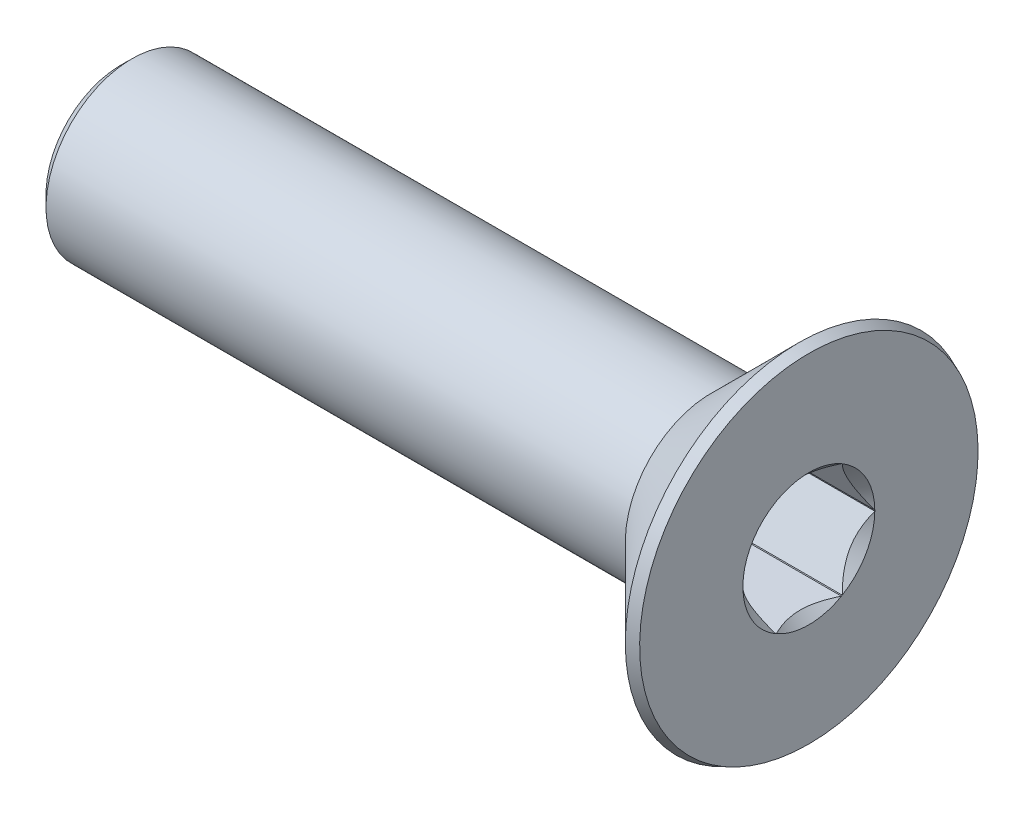
ISO-10303-21;
HEADER;
FILE_DESCRIPTION(('STEP AP214'),'2;1');
FILE_NAME('part.step','',(''),(''),'','','');
FILE_SCHEMA(('AUTOMOTIVE_DESIGN { 1 0 10303 214 1 1 1 1 }'));
ENDSEC;
DATA;
#1=APPLICATION_CONTEXT('core data for automotive mechanical design processes');
#2=APPLICATION_PROTOCOL_DEFINITION('international standard','automotive_design',2000,#1);
#3=PRODUCT_CONTEXT('',#1,'mechanical');
#4=PRODUCT('Part','Part','',(#3));
#5=PRODUCT_RELATED_PRODUCT_CATEGORY('part','',(#4));
#6=PRODUCT_DEFINITION_FORMATION('','',#4);
#7=PRODUCT_DEFINITION_CONTEXT('part definition',#1,'design');
#8=PRODUCT_DEFINITION('design','',#6,#7);
#9=PRODUCT_DEFINITION_SHAPE('','',#8);
#10=(LENGTH_UNIT() NAMED_UNIT(*) SI_UNIT(.MILLI.,.METRE.));
#11=(NAMED_UNIT(*) PLANE_ANGLE_UNIT() SI_UNIT($,.RADIAN.));
#12=(NAMED_UNIT(*) SI_UNIT($,.STERADIAN.) SOLID_ANGLE_UNIT());
#13=UNCERTAINTY_MEASURE_WITH_UNIT(LENGTH_MEASURE(1.E-05),#10,'distance_accuracy_value','');
#14=(GEOMETRIC_REPRESENTATION_CONTEXT(3) GLOBAL_UNCERTAINTY_ASSIGNED_CONTEXT((#13)) GLOBAL_UNIT_ASSIGNED_CONTEXT((#10,
#11,#12)) REPRESENTATION_CONTEXT('',''));
#15=CARTESIAN_POINT('',(0.,0.,0.));
#16=DIRECTION('',(0.,0.,1.));
#17=DIRECTION('',(1.,0.,0.));
#18=AXIS2_PLACEMENT_3D('',#15,#16,#17);
#19=CARTESIAN_POINT('',(3.3333911777,-22.5652643177,178.13));
#20=DIRECTION('',(1.,0.,0.));
#21=DIRECTION('',(0.,1.,0.));
#22=AXIS2_PLACEMENT_3D('',#19,#20,#21);
#23=CYLINDRICAL_SURFACE('',#22,1.15);
#24=CARTESIAN_POINT('',(3.3333911777,-22.5652643177,178.13));
#25=DIRECTION('',(1.,0.,0.));
#26=DIRECTION('',(0.,1.,0.));
#27=AXIS2_PLACEMENT_3D('',#24,#25,#26);
#28=CIRCLE('',#27,1.15);
#29=CARTESIAN_POINT('',(3.33339117770549,-21.5734564283759,177.547920013506));
#30=VERTEX_POINT('',#29);
#31=CARTESIAN_POINT('',(3.33339117770511,-21.5652643177,177.56210916542));
#32=VERTEX_POINT('',#31);
#33=EDGE_CURVE('E118',#30,#32,#28,.T.);
#34=ORIENTED_EDGE('',*,*,#33,.F.);
#35=DIRECTION('',(1.,0.,0.));
#36=VECTOR('',#35,1.);
#37=CARTESIAN_POINT('',(6.0333911777,-21.5734564283741,177.547920013507));
#38=LINE('',#37,#36);
#39=CARTESIAN_POINT('',(5.03339117772478,-21.5734564283759,177.547920013506));
#40=VERTEX_POINT('',#39);
#41=EDGE_CURVE('E120',#40,#30,#38,.F.);
#42=ORIENTED_EDGE('',*,*,#41,.F.);
#43=CARTESIAN_POINT('',(5.0333911777,-22.5652643177,178.13));
#44=DIRECTION('',(-1.,0.,0.));
#45=DIRECTION('',(0.,-1.,0.));
#46=AXIS2_PLACEMENT_3D('',#43,#44,#45);
#47=CIRCLE('',#46,1.15);
#48=CARTESIAN_POINT('',(5.03339117772374,-21.5652643177,177.56210916542));
#49=VERTEX_POINT('',#48);
#50=EDGE_CURVE('E19',#49,#40,#47,.T.);
#51=ORIENTED_EDGE('',*,*,#50,.F.);
#52=DIRECTION('',(1.,0.,0.));
#53=VECTOR('',#52,1.);
#54=CARTESIAN_POINT('',(6.0333911777,-21.5652643177,177.56210916542));
#55=LINE('',#54,#53);
#56=EDGE_CURVE('E237',#32,#49,#55,.T.);
#57=ORIENTED_EDGE('',*,*,#56,.F.);
#58=EDGE_LOOP('',(#34,#42,#51,#57));
#59=FACE_BOUND('',#58,.T.);
#60=ADVANCED_FACE('F16',(#59),#23,.F.);
#61=CARTESIAN_POINT('',(3.3333911777,-22.5652643177,178.13));
#62=DIRECTION('',(1.,0.,0.));
#63=DIRECTION('',(0.,1.,0.));
#64=AXIS2_PLACEMENT_3D('',#61,#62,#63);
#65=CYLINDRICAL_SURFACE('',#64,1.15);
#66=CARTESIAN_POINT('',(3.3333911777,-22.5652643177,178.13));
#67=DIRECTION('',(1.,0.,0.));
#68=DIRECTION('',(0.,1.,0.));
#69=AXIS2_PLACEMENT_3D('',#66,#67,#68);
#70=CIRCLE('',#69,1.15);
#71=CARTESIAN_POINT('',(3.33339117770511,-21.5652643177,178.69789083458));
#72=VERTEX_POINT('',#71);
#73=CARTESIAN_POINT('',(3.33339117770457,-21.5734564283715,178.712079986482));
#74=VERTEX_POINT('',#73);
#75=EDGE_CURVE('E193',#72,#74,#70,.T.);
#76=ORIENTED_EDGE('',*,*,#75,.F.);
#77=DIRECTION('',(1.,0.,0.));
#78=VECTOR('',#77,1.);
#79=CARTESIAN_POINT('',(6.0333911777,-21.5652643177,178.69789083458));
#80=LINE('',#79,#78);
#81=CARTESIAN_POINT('',(5.03339117772374,-21.5652643177,178.69789083458));
#82=VERTEX_POINT('',#81);
#83=EDGE_CURVE('E125',#82,#72,#80,.F.);
#84=ORIENTED_EDGE('',*,*,#83,.F.);
#85=CARTESIAN_POINT('',(5.0333911777,-22.5652643177,178.13));
#86=DIRECTION('',(-1.,0.,0.));
#87=DIRECTION('',(0.,-1.,0.));
#88=AXIS2_PLACEMENT_3D('',#85,#86,#87);
#89=CIRCLE('',#88,1.15);
#90=CARTESIAN_POINT('',(5.03339117772227,-21.5734564283715,178.712079986482));
#91=VERTEX_POINT('',#90);
#92=EDGE_CURVE('E194',#91,#82,#89,.T.);
#93=ORIENTED_EDGE('',*,*,#92,.F.);
#94=DIRECTION('',(1.,0.,0.));
#95=VECTOR('',#94,1.);
#96=CARTESIAN_POINT('',(6.0333911777,-21.5734564283741,178.712079986483));
#97=LINE('',#96,#95);
#98=EDGE_CURVE('E236',#74,#91,#97,.T.);
#99=ORIENTED_EDGE('',*,*,#98,.F.);
#100=EDGE_LOOP('',(#76,#84,#93,#99));
#101=FACE_BOUND('',#100,.T.);
#102=ADVANCED_FACE('F388',(#101),#65,.F.);
#103=CARTESIAN_POINT('',(3.3333911777,-22.5652643177,178.13));
#104=DIRECTION('',(1.,0.,0.));
#105=DIRECTION('',(0.,1.,0.));
#106=AXIS2_PLACEMENT_3D('',#103,#104,#105);
#107=CYLINDRICAL_SURFACE('',#106,1.15);
#108=CARTESIAN_POINT('',(3.3333911777,-22.5652643177,178.13));
#109=DIRECTION('',(1.,0.,0.));
#110=DIRECTION('',(0.,1.,0.));
#111=AXIS2_PLACEMENT_3D('',#108,#109,#110);
#112=CIRCLE('',#111,1.15);
#113=CARTESIAN_POINT('',(3.33339117770344,-22.5570722070308,179.27997082107));
#114=VERTEX_POINT('',#113);
#115=CARTESIAN_POINT('',(3.33339117770557,-22.5734564283763,179.279970821076));
#116=VERTEX_POINT('',#115);
#117=EDGE_CURVE('E191',#114,#116,#112,.T.);
#118=ORIENTED_EDGE('',*,*,#117,.F.);
#119=DIRECTION('',(1.,0.,0.));
#120=VECTOR('',#119,1.);
#121=CARTESIAN_POINT('',(6.0333911777,-22.5570722070227,179.279970821065));
#122=LINE('',#121,#120);
#123=CARTESIAN_POINT('',(5.03339117771689,-22.5570722070269,179.279970821068));
#124=VERTEX_POINT('',#123);
#125=EDGE_CURVE('E231',#124,#114,#122,.F.);
#126=ORIENTED_EDGE('',*,*,#125,.F.);
#127=CARTESIAN_POINT('',(5.0333911777,-22.5652643177,178.13));
#128=DIRECTION('',(-1.,0.,0.));
#129=DIRECTION('',(0.,-1.,0.));
#130=AXIS2_PLACEMENT_3D('',#127,#128,#129);
#131=CIRCLE('',#130,1.15);
#132=CARTESIAN_POINT('',(5.03339117772502,-22.5734564283763,179.279970821076));
#133=VERTEX_POINT('',#132);
#134=EDGE_CURVE('E192',#133,#124,#131,.T.);
#135=ORIENTED_EDGE('',*,*,#134,.F.);
#136=DIRECTION('',(1.,0.,0.));
#137=VECTOR('',#136,1.);
#138=CARTESIAN_POINT('',(6.0333911777,-22.573456428374,179.279970821077));
#139=LINE('',#138,#137);
#140=EDGE_CURVE('E309',#116,#133,#139,.T.);
#141=ORIENTED_EDGE('',*,*,#140,.F.);
#142=EDGE_LOOP('',(#118,#126,#135,#141));
#143=FACE_BOUND('',#142,.T.);
#144=ADVANCED_FACE('F232',(#143),#107,.F.);
#145=CARTESIAN_POINT('',(3.3333911777,-22.5652643177,178.13));
#146=DIRECTION('',(1.,0.,0.));
#147=DIRECTION('',(0.,1.,0.));
#148=AXIS2_PLACEMENT_3D('',#145,#146,#147);
#149=CYLINDRICAL_SURFACE('',#148,1.15);
#150=CARTESIAN_POINT('',(3.3333911777,-22.5652643177,178.13));
#151=DIRECTION('',(1.,0.,0.));
#152=DIRECTION('',(0.,1.,0.));
#153=AXIS2_PLACEMENT_3D('',#150,#151,#152);
#154=CIRCLE('',#153,1.15);
#155=CARTESIAN_POINT('',(3.33339117770515,-23.5570722070225,178.712079986495));
#156=VERTEX_POINT('',#155);
#157=CARTESIAN_POINT('',(3.33339117770511,-23.5652643177,178.69789083458));
#158=VERTEX_POINT('',#157);
#159=EDGE_CURVE('E188',#156,#158,#154,.T.);
#160=ORIENTED_EDGE('',*,*,#159,.F.);
#161=DIRECTION('',(1.,0.,0.));
#162=VECTOR('',#161,1.);
#163=CARTESIAN_POINT('',(6.0333911777,-23.5570722070227,178.712079986495));
#164=LINE('',#163,#162);
#165=CARTESIAN_POINT('',(5.03339117772386,-23.5570722070231,178.712079986494));
#166=VERTEX_POINT('',#165);
#167=EDGE_CURVE('E314',#166,#156,#164,.F.);
#168=ORIENTED_EDGE('',*,*,#167,.F.);
#169=CARTESIAN_POINT('',(5.0333911777,-22.5652643177,178.13));
#170=DIRECTION('',(-1.,0.,0.));
#171=DIRECTION('',(0.,-1.,0.));
#172=AXIS2_PLACEMENT_3D('',#169,#170,#171);
#173=CIRCLE('',#172,1.15);
#174=CARTESIAN_POINT('',(5.03339117772374,-23.5652643177,178.69789083458));
#175=VERTEX_POINT('',#174);
#176=EDGE_CURVE('E189',#175,#166,#173,.T.);
#177=ORIENTED_EDGE('',*,*,#176,.F.);
#178=DIRECTION('',(-1.,0.,0.));
#179=VECTOR('',#178,1.);
#180=CARTESIAN_POINT('',(6.0333911777,-23.5652643177,178.69789083458));
#181=LINE('',#180,#179);
#182=EDGE_CURVE('E296',#158,#175,#181,.F.);
#183=ORIENTED_EDGE('',*,*,#182,.F.);
#184=EDGE_LOOP('',(#160,#168,#177,#183));
#185=FACE_BOUND('',#184,.T.);
#186=ADVANCED_FACE('F306',(#185),#149,.F.);
#187=CARTESIAN_POINT('',(3.3333911777,-22.5652643177,178.13));
#188=DIRECTION('',(1.,0.,0.));
#189=DIRECTION('',(0.,1.,0.));
#190=AXIS2_PLACEMENT_3D('',#187,#188,#189);
#191=CYLINDRICAL_SURFACE('',#190,1.15);
#192=CARTESIAN_POINT('',(3.3333911777,-22.5652643177,178.13));
#193=DIRECTION('',(1.,0.,0.));
#194=DIRECTION('',(0.,1.,0.));
#195=AXIS2_PLACEMENT_3D('',#192,#193,#194);
#196=CIRCLE('',#195,1.15);
#197=CARTESIAN_POINT('',(3.33339117770511,-23.5652643177,177.56210916542));
#198=VERTEX_POINT('',#197);
#199=CARTESIAN_POINT('',(3.33339117770472,-23.5570722070203,177.547920013504));
#200=VERTEX_POINT('',#199);
#201=EDGE_CURVE('E126',#198,#200,#196,.T.);
#202=ORIENTED_EDGE('',*,*,#201,.F.);
#203=DIRECTION('',(-1.,0.,0.));
#204=VECTOR('',#203,1.);
#205=CARTESIAN_POINT('',(6.0333911777,-23.5652643177,177.56210916542));
#206=LINE('',#205,#204);
#207=CARTESIAN_POINT('',(5.03339117772374,-23.5652643177,177.56210916542));
#208=VERTEX_POINT('',#207);
#209=EDGE_CURVE('E299',#208,#198,#206,.T.);
#210=ORIENTED_EDGE('',*,*,#209,.F.);
#211=CARTESIAN_POINT('',(5.0333911777,-22.5652643177,178.13));
#212=DIRECTION('',(-1.,0.,0.));
#213=DIRECTION('',(0.,-1.,0.));
#214=AXIS2_PLACEMENT_3D('',#211,#212,#213);
#215=CIRCLE('',#214,1.15);
#216=CARTESIAN_POINT('',(5.03339117772266,-23.5570722070203,177.547920013504));
#217=VERTEX_POINT('',#216);
#218=EDGE_CURVE('E186',#217,#208,#215,.T.);
#219=ORIENTED_EDGE('',*,*,#218,.F.);
#220=DIRECTION('',(1.,0.,0.));
#221=VECTOR('',#220,1.);
#222=CARTESIAN_POINT('',(6.0333911777,-23.5570722070184,177.547920013503));
#223=LINE('',#222,#221);
#224=EDGE_CURVE('E181',#200,#217,#223,.T.);
#225=ORIENTED_EDGE('',*,*,#224,.F.);
#226=EDGE_LOOP('',(#202,#210,#219,#225));
#227=FACE_BOUND('',#226,.T.);
#228=ADVANCED_FACE('F380',(#227),#191,.F.);
#229=CARTESIAN_POINT('',(6.0333911777,-21.5652643177,177.55264973081));
#230=DIRECTION('',(0.,-0.50000000000019,0.866025403784329));
#231=DIRECTION('',(0.,-0.866025403784329,-0.50000000000019));
#232=AXIS2_PLACEMENT_3D('',#229,#230,#231);
#233=PLANE('',#232);
#234=CARTESIAN_POINT('',(3.33339117770996,-21.573456428379,177.547920013504));
#235=CARTESIAN_POINT('',(3.3249330269977,-21.6141953195101,177.524399403743));
#236=CARTESIAN_POINT('',(3.31724672331336,-21.6550662207822,177.500802577892));
#237=CARTESIAN_POINT('',(3.30373346471285,-21.7370668502727,177.453459492382));
#238=CARTESIAN_POINT('',(3.29790788354163,-21.7781967469649,177.429713135455));
#239=CARTESIAN_POINT('',(3.28848860798743,-21.8602712214272,177.38232741553));
#240=CARTESIAN_POINT('',(3.28487489664175,-21.9012140291637,177.358689074462));
#241=CARTESIAN_POINT('',(3.28002879471618,-21.9831926892112,177.311358673016));
#242=CARTESIAN_POINT('',(3.27879556162498,-22.0242285034549,177.287666634616));
#243=CARTESIAN_POINT('',(3.27879556162494,-22.1063001319422,177.240282557816));
#244=CARTESIAN_POINT('',(3.28002879471609,-22.1473359461858,177.216590519416));
#245=CARTESIAN_POINT('',(3.28487489664158,-22.2293146062333,177.16926011797));
#246=CARTESIAN_POINT('',(3.28848860798723,-22.2702574139698,177.145621776902));
#247=CARTESIAN_POINT('',(3.29790788354135,-22.3523318884321,177.098236056977));
#248=CARTESIAN_POINT('',(3.30373346471254,-22.3934617851243,177.07448970005));
#249=CARTESIAN_POINT('',(3.31724672331298,-22.4754624146148,177.02714661454));
#250=CARTESIAN_POINT('',(3.3249330269973,-22.516333315887,177.003549788689));
#251=CARTESIAN_POINT('',(3.33339117770953,-22.5570722070181,176.980029178927));
#252=B_SPLINE_CURVE_WITH_KNOTS('',3,(#234,#235,#236,#237,#238,#239,#240,#241,#242,#243,#244,
#245,#246,#247,#248,#249,#250,#251),.UNSPECIFIED.,.F.,.F.,(4,2,2,2,2,2,2,2,4),(0.,
0.143400587529677,0.286906802260735,0.429094334749749,0.571231534249904,0.713368733750055,
0.855556266239072,0.999062480970127,1.14246306849983),.UNSPECIFIED.);
#253=CARTESIAN_POINT('',(3.33339117770477,-22.5570722070191,176.980029178927));
#254=VERTEX_POINT('',#253);
#255=EDGE_CURVE('E321',#30,#254,#252,.T.);
#256=ORIENTED_EDGE('',*,*,#255,.T.);
#257=DIRECTION('',(1.,0.,0.));
#258=VECTOR('',#257,1.);
#259=CARTESIAN_POINT('',(3.3333911777,-22.55707220702,176.980029178926));
#260=LINE('',#259,#258);
#261=CARTESIAN_POINT('',(5.03339117772375,-22.55707220702,176.980029178926));
#262=VERTEX_POINT('',#261);
#263=EDGE_CURVE('E132',#254,#262,#260,.T.);
#264=ORIENTED_EDGE('',*,*,#263,.T.);
#265=CARTESIAN_POINT('',(5.03339117774062,-22.5570722070094,176.980029178933));
#266=CARTESIAN_POINT('',(5.0140868733409,-22.5231882795344,176.999592073581));
#267=CARTESIAN_POINT('',(4.99593845726014,-22.4887428394203,177.019479157704));
#268=CARTESIAN_POINT('',(4.96274908779519,-22.4185333290583,177.060014637411));
#269=CARTESIAN_POINT('',(4.9477259430806,-22.3827630005034,177.080666646231));
#270=CARTESIAN_POINT('',(4.92201492889679,-22.3106394296964,177.122307209251));
#271=CARTESIAN_POINT('',(4.9112643303234,-22.2743034432312,177.143285800818));
#272=CARTESIAN_POINT('',(4.89472363622478,-22.2008560884682,177.185690650862));
#273=CARTESIAN_POINT('',(4.88892171507279,-22.163746786966,177.207115716074));
#274=CARTESIAN_POINT('',(4.88367875841517,-22.099380248172,177.244277754573));
#275=CARTESIAN_POINT('',(4.8829332749302,-22.0722002176509,177.259970152511));
#276=CARTESIAN_POINT('',(4.88439360695065,-22.0178971966377,177.291322016311));
#277=CARTESIAN_POINT('',(4.88660010847758,-21.9907742208719,177.306981473671));
#278=CARTESIAN_POINT('',(4.89749944482835,-21.9098016325089,177.353731019359));
#279=CARTESIAN_POINT('',(4.91047299049997,-21.8563600369965,177.384585538914));
#280=CARTESIAN_POINT('',(4.94114265261795,-21.7642450043263,177.437768177823));
#281=CARTESIAN_POINT('',(4.95699333845404,-21.7250708189487,177.460385404296));
#282=CARTESIAN_POINT('',(4.99258085077193,-21.648202461662,177.504765371067));
#283=CARTESIAN_POINT('',(5.0123047954768,-21.6105038675813,177.526530664508));
#284=CARTESIAN_POINT('',(5.03339117774144,-21.5734564283883,177.547920013499));
#285=B_SPLINE_CURVE_WITH_KNOTS('',3,(#265,#266,#267,#268,#269,#270,#271,#272,#273,#274,#275,
#276,#277,#278,#279,#280,#281,#282,#283,#284),.UNSPECIFIED.,.F.,.F.,(4,2,2,2,2,2,2,2,2,4),(0.,
0.13097402612549,0.262675086145719,0.392363968763176,0.521742064544273,0.615786259227387,
0.709852312947311,0.898024321761643,1.04164336130838,1.18479260075275),.UNSPECIFIED.);
#286=EDGE_CURVE('E129',#262,#40,#285,.T.);
#287=ORIENTED_EDGE('',*,*,#286,.T.);
#288=ORIENTED_EDGE('',*,*,#41,.T.);
#289=EDGE_LOOP('',(#256,#264,#287,#288));
#290=FACE_BOUND('',#289,.T.);
#291=ADVANCED_FACE('F130',(#290),#233,.T.);
#292=CARTESIAN_POINT('',(6.0333911777,-21.5652643177,178.70735026919));
#293=DIRECTION('',(0.,-1.,0.));
#294=DIRECTION('',(1.,0.,0.));
#295=AXIS2_PLACEMENT_3D('',#292,#293,#294);
#296=PLANE('',#295);
#297=CARTESIAN_POINT('',(3.33339117770962,-21.5652643177,178.697890834577));
#298=CARTESIAN_POINT('',(3.32493302699737,-21.5652643177,178.650849615055));
#299=CARTESIAN_POINT('',(3.31724672331303,-21.5652643177,178.603655963352));
#300=CARTESIAN_POINT('',(3.30373346471255,-21.5652643177,178.508969792331));
#301=CARTESIAN_POINT('',(3.29790788354133,-21.5652643177,178.461477078477));
#302=CARTESIAN_POINT('',(3.28848860798717,-21.5652643177,178.366705638629));
#303=CARTESIAN_POINT('',(3.2848748966415,-21.5652643177,178.319428956492));
#304=CARTESIAN_POINT('',(3.28002879471597,-21.5652643177,178.2247681536));
#305=CARTESIAN_POINT('',(3.27879556162479,-21.5652643177,178.1773840768));
#306=CARTESIAN_POINT('',(3.27879556162479,-21.5652643177,178.0826159232));
#307=CARTESIAN_POINT('',(3.28002879471597,-21.5652643177,178.0352318464));
#308=CARTESIAN_POINT('',(3.2848748966415,-21.5652643177,177.940571043508));
#309=CARTESIAN_POINT('',(3.28848860798717,-21.5652643177,177.893294361371));
#310=CARTESIAN_POINT('',(3.29790788354133,-21.5652643177,177.798522921523));
#311=CARTESIAN_POINT('',(3.30373346471255,-21.5652643177,177.751030207669));
#312=CARTESIAN_POINT('',(3.31724672331303,-21.5652643177,177.656344036648));
#313=CARTESIAN_POINT('',(3.32493302699737,-21.5652643177,177.609150384945));
#314=CARTESIAN_POINT('',(3.33339117770962,-21.5652643177,177.562109165423));
#315=B_SPLINE_CURVE_WITH_KNOTS('',3,(#297,#298,#299,#300,#301,#302,#303,#304,#305,#306,#307,
#308,#309,#310,#311,#312,#313,#314),.UNSPECIFIED.,.F.,.F.,(4,2,2,2,2,2,2,2,4),(0.,
0.143400587529756,0.286906802260814,0.429094334749866,0.571231534250032,0.713368733750197,
0.85555626623925,0.999062480970308,1.14246306850006),.UNSPECIFIED.);
#316=EDGE_CURVE('E276',#72,#32,#315,.T.);
#317=ORIENTED_EDGE('',*,*,#316,.T.);
#318=ORIENTED_EDGE('',*,*,#56,.T.);
#319=CARTESIAN_POINT('',(5.03339117773556,-21.5652643176881,177.562109165431));
#320=CARTESIAN_POINT('',(5.01408687333897,-21.5652643176957,177.601234954731));
#321=CARTESIAN_POINT('',(4.99593845725937,-21.5652643176988,177.641009122976));
#322=CARTESIAN_POINT('',(4.96274908779501,-21.5652643177012,177.722080082392));
#323=CARTESIAN_POINT('',(4.94772594307984,-21.5652643177003,177.763384100033));
#324=CARTESIAN_POINT('',(4.92201492889549,-21.5652643176997,177.846665226075));
#325=CARTESIAN_POINT('',(4.91126433032213,-21.5652643176999,177.888622409209));
#326=CARTESIAN_POINT('',(4.89472363622362,-21.5652643177001,177.973432109298));
#327=CARTESIAN_POINT('',(4.88892171507172,-21.5652643177,178.016282239722));
#328=CARTESIAN_POINT('',(4.88367875841446,-21.5652643177,178.090606316722));
#329=CARTESIAN_POINT('',(4.88293327492969,-21.5652643177,178.121991112598));
#330=CARTESIAN_POINT('',(4.88439360695055,-21.5652643177,178.184694840198));
#331=CARTESIAN_POINT('',(4.8866001084777,-21.5652643177,178.216013754918));
#332=CARTESIAN_POINT('',(4.89749944482915,-21.5652643177,178.309512846295));
#333=CARTESIAN_POINT('',(4.91047299050123,-21.5652643177,178.371221885405));
#334=CARTESIAN_POINT('',(4.94114265261959,-21.5652643177,178.477587163221));
#335=CARTESIAN_POINT('',(4.95699333845546,-21.5652643177,178.522821616166));
#336=CARTESIAN_POINT('',(4.99258085077269,-21.5652643177,178.611581549707));
#337=CARTESIAN_POINT('',(5.01230479547712,-21.5652643177,178.655112136587));
#338=CARTESIAN_POINT('',(5.03339117774126,-21.5652643177,178.697890834567));
#339=B_SPLINE_CURVE_WITH_KNOTS('',3,(#319,#320,#321,#322,#323,#324,#325,#326,#327,#328,#329,
#330,#331,#332,#333,#334,#335,#336,#337,#338),.UNSPECIFIED.,.F.,.F.,(4,2,2,2,2,2,2,2,2,4),(0.,
0.130974026127057,0.262675086149201,0.392363968768692,0.521742064551702,0.615786259235275,
0.709852312955758,0.898024321770856,1.04164336131394,1.18479260075476),.UNSPECIFIED.);
#340=EDGE_CURVE('E134',#49,#82,#339,.T.);
#341=ORIENTED_EDGE('',*,*,#340,.T.);
#342=ORIENTED_EDGE('',*,*,#83,.T.);
#343=EDGE_LOOP('',(#317,#318,#341,#342));
#344=FACE_BOUND('',#343,.T.);
#345=ADVANCED_FACE('F265',(#344),#296,.T.);
#346=CARTESIAN_POINT('',(6.0333911777,-22.5652643177,179.28470053837));
#347=DIRECTION('',(0.,-0.50000000000019,-0.866025403784329));
#348=DIRECTION('',(0.,0.866025403784329,-0.50000000000019));
#349=AXIS2_PLACEMENT_3D('',#346,#347,#348);
#350=PLANE('',#349);
#351=CARTESIAN_POINT('',(3.33339117770658,-22.5570722070213,179.279970821064));
#352=CARTESIAN_POINT('',(3.32493302699426,-22.51633331589,179.256450211303));
#353=CARTESIAN_POINT('',(3.31724672330988,-22.4754624146176,179.232853385452));
#354=CARTESIAN_POINT('',(3.30373346470933,-22.3934617851267,179.185510299941));
#355=CARTESIAN_POINT('',(3.29790788353809,-22.3523318884343,179.161763943014));
#356=CARTESIAN_POINT('',(3.28848860798394,-22.2702574139716,179.11437822309));
#357=CARTESIAN_POINT('',(3.28487489663829,-22.229314606235,179.090739882021));
#358=CARTESIAN_POINT('',(3.28002879471285,-22.1473359461871,179.043409480575));
#359=CARTESIAN_POINT('',(3.27879556162174,-22.1063001319432,179.019717442175));
#360=CARTESIAN_POINT('',(3.27879556162192,-22.0242285034555,178.972333365375));
#361=CARTESIAN_POINT('',(3.28002879471321,-21.9831926892117,178.948641326974));
#362=CARTESIAN_POINT('',(3.284874896639,-21.9012140291638,178.901310925528));
#363=CARTESIAN_POINT('',(3.28848860798481,-21.8602712214272,178.87767258446));
#364=CARTESIAN_POINT('',(3.29790788353928,-21.7781967469645,178.830286864535));
#365=CARTESIAN_POINT('',(3.30373346471066,-21.7370668502721,178.806540507608));
#366=CARTESIAN_POINT('',(3.31724672331147,-21.6550662207813,178.759197422098));
#367=CARTESIAN_POINT('',(3.32493302699598,-21.6141953195089,178.735600596246));
#368=CARTESIAN_POINT('',(3.33339117770841,-21.5734564283776,178.712079986485));
#369=B_SPLINE_CURVE_WITH_KNOTS('',3,(#351,#352,#353,#354,#355,#356,#357,#358,#359,#360,#361,
#362,#363,#364,#365,#366,#367,#368),.UNSPECIFIED.,.F.,.F.,(4,2,2,2,2,2,2,2,4),(0.,
0.143400587530371,0.286906802262135,0.429094334751811,0.571231534252625,0.713368733753432,
0.855556266243112,0.99906248097483,1.14246306850521),.UNSPECIFIED.);
#370=EDGE_CURVE('E271',#114,#74,#369,.T.);
#371=ORIENTED_EDGE('',*,*,#370,.T.);
#372=ORIENTED_EDGE('',*,*,#98,.T.);
#373=CARTESIAN_POINT('',(5.03339117773797,-21.5734564283856,178.71207998649));
#374=CARTESIAN_POINT('',(5.01408687333762,-21.6073403558611,178.731642881139));
#375=CARTESIAN_POINT('',(4.99593845725623,-21.6417857959756,178.751529965261));
#376=CARTESIAN_POINT('',(4.96274908779008,-21.7119953063386,178.792065444969));
#377=CARTESIAN_POINT('',(4.9477259430749,-21.747765634894,178.81271745379));
#378=CARTESIAN_POINT('',(4.92201492889006,-21.8198892057021,178.854358016811));
#379=CARTESIAN_POINT('',(4.91126433031621,-21.8562251921678,178.875336608378));
#380=CARTESIAN_POINT('',(4.89472363621683,-21.929672546932,178.917741458422));
#381=CARTESIAN_POINT('',(4.88892171506456,-21.9667818484348,178.939166523634));
#382=CARTESIAN_POINT('',(4.88367875840668,-22.0311483872292,178.976328562134));
#383=CARTESIAN_POINT('',(4.88293327492163,-22.0583284177501,178.992020960072));
#384=CARTESIAN_POINT('',(4.88439360694189,-22.1126314387629,179.023372823871));
#385=CARTESIAN_POINT('',(4.88660010846872,-22.1397544145285,179.039032281231));
#386=CARTESIAN_POINT('',(4.89749944481916,-22.220727002891,179.085781826919));
#387=CARTESIAN_POINT('',(4.91047299049054,-22.274168598403,179.116636346474));
#388=CARTESIAN_POINT('',(4.94114265260841,-22.3662836310736,179.169818985383));
#389=CARTESIAN_POINT('',(4.95699333844477,-22.4054578164518,179.192436211856));
#390=CARTESIAN_POINT('',(4.99258085076335,-22.4823261737399,179.236816178629));
#391=CARTESIAN_POINT('',(5.01230479546865,-22.5200247678213,179.258581472069));
#392=CARTESIAN_POINT('',(5.03339117773377,-22.5570722070148,179.279970821061));
#393=B_SPLINE_CURVE_WITH_KNOTS('',3,(#373,#374,#375,#376,#377,#378,#379,#380,#381,#382,#383,
#384,#385,#386,#387,#388,#389,#390,#391,#392),.UNSPECIFIED.,.F.,.F.,(4,2,2,2,2,2,2,2,2,4),(0.,
0.130974026127718,0.262675086150222,0.392363968769874,0.52174206455313,0.615786259235568,
0.709852312954807,0.898024321767734,1.04164336131699,1.1847926007639),.UNSPECIFIED.);
#394=EDGE_CURVE('E224',#91,#124,#393,.T.);
#395=ORIENTED_EDGE('',*,*,#394,.T.);
#396=ORIENTED_EDGE('',*,*,#125,.T.);
#397=EDGE_LOOP('',(#371,#372,#395,#396));
#398=FACE_BOUND('',#397,.T.);
#399=ADVANCED_FACE('F240',(#398),#350,.T.);
#400=CARTESIAN_POINT('',(6.0333911777,-23.5652643177,178.70735026919));
#401=DIRECTION('',(0.,0.50000000000019,-0.866025403784329));
#402=DIRECTION('',(0.,0.866025403784329,0.50000000000019));
#403=AXIS2_PLACEMENT_3D('',#400,#401,#402);
#404=PLANE('',#403);
#405=CARTESIAN_POINT('',(3.33339117770991,-23.5570722070208,178.712079986496));
#406=CARTESIAN_POINT('',(3.3249330269976,-23.5163333158895,178.735600596257));
#407=CARTESIAN_POINT('',(3.31724672331322,-23.475462414617,178.759197422109));
#408=CARTESIAN_POINT('',(3.30373346471267,-23.3934617851261,178.806540507619));
#409=CARTESIAN_POINT('',(3.29790788354143,-23.3523318884336,178.830286864546));
#410=CARTESIAN_POINT('',(3.28848860798724,-23.2702574139708,178.877672584471));
#411=CARTESIAN_POINT('',(3.28487489664157,-23.2293146062341,178.901310925539));
#412=CARTESIAN_POINT('',(3.28002879471607,-23.1473359461862,178.948641326986));
#413=CARTESIAN_POINT('',(3.27879556162491,-23.1063001319423,178.972333365386));
#414=CARTESIAN_POINT('',(3.27879556162499,-23.0242285034545,179.019717442186));
#415=CARTESIAN_POINT('',(3.28002879471622,-22.9831926892106,179.043409480586));
#416=CARTESIAN_POINT('',(3.28487489664189,-22.9012140291627,179.090739882033));
#417=CARTESIAN_POINT('',(3.28848860798763,-22.860271221426,179.114378223101));
#418=CARTESIAN_POINT('',(3.29790788354195,-22.7781967469632,179.161763943026));
#419=CARTESIAN_POINT('',(3.30373346471326,-22.7370668502708,179.185510299953));
#420=CARTESIAN_POINT('',(3.31724672331393,-22.6550662207798,179.232853385463));
#421=CARTESIAN_POINT('',(3.32493302699837,-22.6141953195074,179.256450211315));
#422=CARTESIAN_POINT('',(3.33339117771072,-22.5734564283761,179.279970821076));
#423=B_SPLINE_CURVE_WITH_KNOTS('',3,(#405,#406,#407,#408,#409,#410,#411,#412,#413,#414,#415,
#416,#417,#418,#419,#420,#421,#422),.UNSPECIFIED.,.F.,.F.,(4,2,2,2,2,2,2,2,4),(0.,
0.1434005875305,0.286906802262375,0.429094334752203,0.571231534253146,0.713368733754105,
0.855556266243926,0.999062480975802,1.14246306850629),.UNSPECIFIED.);
#424=EDGE_CURVE('E277',#156,#116,#423,.T.);
#425=ORIENTED_EDGE('',*,*,#424,.T.);
#426=ORIENTED_EDGE('',*,*,#140,.T.);
#427=CARTESIAN_POINT('',(5.03339117773897,-22.573456428389,179.27997082108));
#428=CARTESIAN_POINT('',(5.01408687334156,-22.6073403558626,179.260407926424));
#429=CARTESIAN_POINT('',(4.99593845726152,-22.6417857959763,179.240520842299));
#430=CARTESIAN_POINT('',(4.96274908779661,-22.711995306339,179.19998536259));
#431=CARTESIAN_POINT('',(4.94772594308135,-22.7477656348948,179.17933335377));
#432=CARTESIAN_POINT('',(4.92201492889674,-22.8198892057034,179.137692790749));
#433=CARTESIAN_POINT('',(4.9112643303232,-22.8562251921692,179.116714199181));
#434=CARTESIAN_POINT('',(4.89472363622441,-22.9296725469337,179.074309349137));
#435=CARTESIAN_POINT('',(4.8889217150724,-22.9667818484366,179.052884283925));
#436=CARTESIAN_POINT('',(4.88367875841497,-23.0311483872315,179.015722245425));
#437=CARTESIAN_POINT('',(4.88293327493014,-23.0583284177527,179.000029847487));
#438=CARTESIAN_POINT('',(4.88439360695087,-23.1126314387662,178.968677983687));
#439=CARTESIAN_POINT('',(4.88660010847796,-23.1397544145321,178.953018526327));
#440=CARTESIAN_POINT('',(4.89749944482921,-23.2207270028955,178.906268980638));
#441=CARTESIAN_POINT('',(4.91047299050117,-23.274168598408,178.875414461083));
#442=CARTESIAN_POINT('',(4.94114265261948,-23.3662836310777,178.822231822175));
#443=CARTESIAN_POINT('',(4.95699333845545,-23.4054578164546,178.799614595702));
#444=CARTESIAN_POINT('',(4.99258085077296,-23.4823261737401,178.755234628931));
#445=CARTESIAN_POINT('',(5.01230479547757,-23.5200247678202,178.733469335491));
#446=CARTESIAN_POINT('',(5.03339117774191,-23.5570722070125,178.712079986501));
#447=B_SPLINE_CURVE_WITH_KNOTS('',3,(#427,#428,#429,#430,#431,#432,#433,#434,#435,#436,#437,
#438,#439,#440,#441,#442,#443,#444,#445,#446),.UNSPECIFIED.,.F.,.F.,(4,2,2,2,2,2,2,2,2,4),(0.,
0.130974026127759,0.262675086150519,0.392363968770584,0.521742064554247,0.615786259237847,
0.709852312958219,0.898024321773323,1.04164336131776,1.18479260075992),.UNSPECIFIED.);
#448=EDGE_CURVE('E242',#133,#166,#447,.T.);
#449=ORIENTED_EDGE('',*,*,#448,.T.);
#450=ORIENTED_EDGE('',*,*,#167,.T.);
#451=EDGE_LOOP('',(#425,#426,#449,#450));
#452=FACE_BOUND('',#451,.T.);
#453=ADVANCED_FACE('F264',(#452),#404,.T.);
#454=CARTESIAN_POINT('',(6.0333911777,-23.5652643177,177.55264973081));
#455=DIRECTION('',(0.,1.,0.));
#456=DIRECTION('',(-1.,0.,0.));
#457=AXIS2_PLACEMENT_3D('',#454,#455,#456);
#458=PLANE('',#457);
#459=CARTESIAN_POINT('',(3.33339117770963,-23.5652643177,177.562109165423));
#460=CARTESIAN_POINT('',(3.32493302699738,-23.5652643177,177.609150384945));
#461=CARTESIAN_POINT('',(3.31724672331304,-23.5652643177,177.656344036648));
#462=CARTESIAN_POINT('',(3.30373346471256,-23.5652643177,177.751030207669));
#463=CARTESIAN_POINT('',(3.29790788354134,-23.5652643177,177.798522921523));
#464=CARTESIAN_POINT('',(3.28848860798718,-23.5652643177,177.893294361371));
#465=CARTESIAN_POINT('',(3.28487489664151,-23.5652643177,177.940571043508));
#466=CARTESIAN_POINT('',(3.28002879471598,-23.5652643177,178.0352318464));
#467=CARTESIAN_POINT('',(3.2787955616248,-23.5652643177,178.0826159232));
#468=CARTESIAN_POINT('',(3.2787955616248,-23.5652643177,178.1773840768));
#469=CARTESIAN_POINT('',(3.28002879471597,-23.5652643177,178.2247681536));
#470=CARTESIAN_POINT('',(3.28487489664151,-23.5652643177,178.319428956492));
#471=CARTESIAN_POINT('',(3.28848860798717,-23.5652643177,178.366705638629));
#472=CARTESIAN_POINT('',(3.29790788354134,-23.5652643177,178.461477078477));
#473=CARTESIAN_POINT('',(3.30373346471255,-23.5652643177,178.508969792331));
#474=CARTESIAN_POINT('',(3.31724672331303,-23.5652643177,178.603655963352));
#475=CARTESIAN_POINT('',(3.32493302699737,-23.5652643177,178.650849615055));
#476=CARTESIAN_POINT('',(3.33339117770962,-23.5652643177,178.697890834577));
#477=B_SPLINE_CURVE_WITH_KNOTS('',3,(#459,#460,#461,#462,#463,#464,#465,#466,#467,#468,#469,
#470,#471,#472,#473,#474,#475,#476),.UNSPECIFIED.,.F.,.F.,(4,2,2,2,2,2,2,2,4),(0.,
0.143400587529728,0.286906802260786,0.429094334749839,0.571231534250032,0.713368733750225,
0.855556266239278,0.999062480970336,1.14246306850006),.UNSPECIFIED.);
#478=EDGE_CURVE('E180',#198,#158,#477,.T.);
#479=ORIENTED_EDGE('',*,*,#478,.T.);
#480=ORIENTED_EDGE('',*,*,#182,.T.);
#481=CARTESIAN_POINT('',(5.03339117773556,-23.565264317712,178.697890834569));
#482=CARTESIAN_POINT('',(5.01408687333897,-23.5652643177043,178.658765045269));
#483=CARTESIAN_POINT('',(4.99593845725938,-23.5652643177012,178.618990877024));
#484=CARTESIAN_POINT('',(4.96274908779501,-23.5652643176988,178.537919917608));
#485=CARTESIAN_POINT('',(4.94772594307984,-23.5652643176997,178.496615899967));
#486=CARTESIAN_POINT('',(4.9220149288955,-23.5652643177003,178.413334773925));
#487=CARTESIAN_POINT('',(4.91126433032213,-23.5652643177001,178.371377590791));
#488=CARTESIAN_POINT('',(4.89472363622362,-23.5652643176999,178.286567890702));
#489=CARTESIAN_POINT('',(4.88892171507173,-23.5652643177,178.243717760278));
#490=CARTESIAN_POINT('',(4.88367875841446,-23.5652643177,178.169393683278));
#491=CARTESIAN_POINT('',(4.88293327492969,-23.5652643177,178.138008887402));
#492=CARTESIAN_POINT('',(4.88439360695055,-23.5652643177,178.075305159802));
#493=CARTESIAN_POINT('',(4.88660010847771,-23.5652643177,178.043986245082));
#494=CARTESIAN_POINT('',(4.89749944482915,-23.5652643177,177.950487153705));
#495=CARTESIAN_POINT('',(4.91047299050123,-23.5652643177,177.888778114595));
#496=CARTESIAN_POINT('',(4.9411426526196,-23.5652643177,177.782412836779));
#497=CARTESIAN_POINT('',(4.95699333845546,-23.5652643177,177.737178383834));
#498=CARTESIAN_POINT('',(4.99258085077269,-23.5652643177,177.648418450293));
#499=CARTESIAN_POINT('',(5.01230479547712,-23.5652643177,177.604887863413));
#500=CARTESIAN_POINT('',(5.03339117774127,-23.5652643177,177.562109165433));
#501=B_SPLINE_CURVE_WITH_KNOTS('',3,(#481,#482,#483,#484,#485,#486,#487,#488,#489,#490,#491,
#492,#493,#494,#495,#496,#497,#498,#499,#500),.UNSPECIFIED.,.F.,.F.,(4,2,2,2,2,2,2,2,2,4),(0.,
0.130974026127056,0.2626750861492,0.392363968768691,0.521742064551701,0.615786259235301,
0.709852312955729,0.898024321770854,1.04164336131394,1.18479260075476),.UNSPECIFIED.);
#502=EDGE_CURVE('E151',#175,#208,#501,.T.);
#503=ORIENTED_EDGE('',*,*,#502,.T.);
#504=ORIENTED_EDGE('',*,*,#209,.T.);
#505=EDGE_LOOP('',(#479,#480,#503,#504));
#506=FACE_BOUND('',#505,.T.);
#507=ADVANCED_FACE('F166',(#506),#458,.T.);
#508=CARTESIAN_POINT('',(6.0333911777,-22.5652643177,176.97529946162));
#509=DIRECTION('',(0.,0.50000000000019,0.866025403784329));
#510=DIRECTION('',(0.,-0.866025403784329,0.50000000000019));
#511=AXIS2_PLACEMENT_3D('',#508,#509,#510);
#512=PLANE('',#511);
#513=CARTESIAN_POINT('',(3.33339117771106,-22.5734564283746,176.980029178923));
#514=CARTESIAN_POINT('',(3.32493302699872,-22.6141953195058,177.003549788684));
#515=CARTESIAN_POINT('',(3.31724672331429,-22.655066220778,177.027146614536));
#516=CARTESIAN_POINT('',(3.30373346471361,-22.7370668502687,177.074489700046));
#517=CARTESIAN_POINT('',(3.29790788354229,-22.7781967469609,177.098236056973));
#518=CARTESIAN_POINT('',(3.28848860798791,-22.8602712214234,177.145621776898));
#519=CARTESIAN_POINT('',(3.28487489664214,-22.9012140291599,177.169260117966));
#520=CARTESIAN_POINT('',(3.28002879471638,-22.9831926892075,177.216590519412));
#521=CARTESIAN_POINT('',(3.27879556162509,-23.0242285034513,177.240282557812));
#522=CARTESIAN_POINT('',(3.27879556162487,-23.1063001319387,177.287666634612));
#523=CARTESIAN_POINT('',(3.28002879471595,-23.1473359461825,177.311358673012));
#524=CARTESIAN_POINT('',(3.28487489664128,-23.2293146062301,177.358689074459));
#525=CARTESIAN_POINT('',(3.28848860798686,-23.2702574139667,177.382327415527));
#526=CARTESIAN_POINT('',(3.29790788354086,-23.3523318884291,177.429713135451));
#527=CARTESIAN_POINT('',(3.303733464712,-23.3934617851214,177.453459492378));
#528=CARTESIAN_POINT('',(3.31724672331236,-23.4754624146121,177.500802577888));
#529=CARTESIAN_POINT('',(3.32493302699664,-23.5163333158844,177.52439940374));
#530=CARTESIAN_POINT('',(3.33339117770884,-23.5570722070156,177.547920013501));
#531=B_SPLINE_CURVE_WITH_KNOTS('',3,(#513,#514,#515,#516,#517,#518,#519,#520,#521,#522,#523,
#524,#525,#526,#527,#528,#529,#530),.UNSPECIFIED.,.F.,.F.,(4,2,2,2,2,2,2,2,4),(0.,
0.143400587529948,0.286906802261264,0.429094334750531,0.571231534250951,0.713368733751388,
0.855556266240644,0.999062480971982,1.14246306850194),.UNSPECIFIED.);
#532=CARTESIAN_POINT('',(3.33339117770553,-22.5734564283723,176.980029178924));
#533=VERTEX_POINT('',#532);
#534=EDGE_CURVE('E173',#533,#200,#531,.T.);
#535=ORIENTED_EDGE('',*,*,#534,.T.);
#536=ORIENTED_EDGE('',*,*,#224,.T.);
#537=CARTESIAN_POINT('',(5.033391177739,-23.5570722070073,177.547920013496));
#538=CARTESIAN_POINT('',(5.01408687333945,-23.5231882795325,177.528357118847));
#539=CARTESIAN_POINT('',(4.99593845725887,-23.4887428394186,177.508470034725));
#540=CARTESIAN_POINT('',(4.96274908779427,-23.4185333290569,177.467934555018));
#541=CARTESIAN_POINT('',(4.94772594307984,-23.3827630005022,177.447282546198));
#542=CARTESIAN_POINT('',(4.92201492889633,-23.3106394296956,177.405641983178));
#543=CARTESIAN_POINT('',(4.91126433032306,-23.2743034432306,177.384663391611));
#544=CARTESIAN_POINT('',(4.89472363622465,-23.200856088468,177.342258541568));
#545=CARTESIAN_POINT('',(4.88892171507275,-23.1637467869661,177.320833476356));
#546=CARTESIAN_POINT('',(4.88367875841519,-23.0993802481722,177.283671437857));
#547=CARTESIAN_POINT('',(4.88293327493025,-23.0722002176512,177.267979039919));
#548=CARTESIAN_POINT('',(4.88439360695074,-23.017897196638,177.236627176119));
#549=CARTESIAN_POINT('',(4.8866001084777,-22.9907742208722,177.220967718759));
#550=CARTESIAN_POINT('',(4.89749944482852,-22.9098016325092,177.174218173071));
#551=CARTESIAN_POINT('',(4.91047299050017,-22.8563600369969,177.143363653516));
#552=CARTESIAN_POINT('',(4.9411426526185,-22.7642450043257,177.090181014607));
#553=CARTESIAN_POINT('',(4.95699333845504,-22.7250708189473,177.067563788133));
#554=CARTESIAN_POINT('',(4.99258085077397,-22.6482024616588,177.023183821361));
#555=CARTESIAN_POINT('',(5.01230479547944,-22.6105038675773,177.00141852792));
#556=CARTESIAN_POINT('',(5.03339117774472,-22.5734564283835,176.980029178928));
#557=B_SPLINE_CURVE_WITH_KNOTS('',3,(#537,#538,#539,#540,#541,#542,#543,#544,#545,#546,#547,
#548,#549,#550,#551,#552,#553,#554,#555,#556),.UNSPECIFIED.,.F.,.F.,(4,2,2,2,2,2,2,2,2,4),(0.,
0.130974026124724,0.262675086144193,0.392363968760866,0.521742064541193,0.615786259224318,
0.709852312944175,0.898024321758489,1.04164336130855,1.18479260075626),.UNSPECIFIED.);
#558=CARTESIAN_POINT('',(5.03339117772214,-22.5734564283771,176.980029178927));
#559=VERTEX_POINT('',#558);
#560=EDGE_CURVE('E34',#217,#559,#557,.T.);
#561=ORIENTED_EDGE('',*,*,#560,.T.);
#562=DIRECTION('',(1.,0.,0.));
#563=VECTOR('',#562,1.);
#564=CARTESIAN_POINT('',(3.3333911777,-22.57345642837,176.980029178925));
#565=LINE('',#564,#563);
#566=EDGE_CURVE('E141',#559,#533,#565,.F.);
#567=ORIENTED_EDGE('',*,*,#566,.T.);
#568=EDGE_LOOP('',(#535,#536,#561,#567));
#569=FACE_BOUND('',#568,.T.);
#570=ADVANCED_FACE('F161',(#569),#512,.T.);
#571=CARTESIAN_POINT('',(3.33339117770493,-22.5652643177,178.13));
#572=DIRECTION('',(1.,0.,0.));
#573=DIRECTION('',(0.,1.,0.));
#574=AXIS2_PLACEMENT_3D('',#571,#572,#573);
#575=CONICAL_SURFACE('',#574,1.14999999998544,1.22172999988494);
#576=CARTESIAN_POINT('',(3.3333911777,-22.5652643177,178.13));
#577=DIRECTION('',(1.,0.,0.));
#578=DIRECTION('',(0.,1.,0.));
#579=AXIS2_PLACEMENT_3D('',#576,#577,#578);
#580=CIRCLE('',#579,1.15);
#581=EDGE_CURVE('E137',#533,#254,#580,.T.);
#582=ORIENTED_EDGE('',*,*,#581,.T.);
#583=ORIENTED_EDGE('',*,*,#255,.F.);
#584=ORIENTED_EDGE('',*,*,#33,.T.);
#585=ORIENTED_EDGE('',*,*,#316,.F.);
#586=ORIENTED_EDGE('',*,*,#75,.T.);
#587=ORIENTED_EDGE('',*,*,#370,.F.);
#588=ORIENTED_EDGE('',*,*,#117,.T.);
#589=ORIENTED_EDGE('',*,*,#424,.F.);
#590=ORIENTED_EDGE('',*,*,#159,.T.);
#591=ORIENTED_EDGE('',*,*,#478,.F.);
#592=ORIENTED_EDGE('',*,*,#201,.T.);
#593=ORIENTED_EDGE('',*,*,#534,.F.);
#594=EDGE_LOOP('',(#582,#583,#584,#585,#586,#587,#588,#589,#590,#591,#592,#593));
#595=FACE_BOUND('',#594,.T.);
#596=CARTESIAN_POINT('',(2.91482478780836,-22.5652643177,178.130000000237));
#597=VERTEX_POINT('',#596);
#598=VERTEX_LOOP('',#597);
#599=FACE_BOUND('',#598,.T.);
#600=ADVANCED_FACE('F165',(#595,#599),#575,.F.);
#601=CARTESIAN_POINT('',(5.03339117767609,-22.5652643177,178.13));
#602=DIRECTION('',(1.,0.,0.));
#603=DIRECTION('',(0.,1.,0.));
#604=AXIS2_PLACEMENT_3D('',#601,#602,#603);
#605=CONICAL_SURFACE('',#604,1.1499999999286,0.785397673135981);
#606=CARTESIAN_POINT('',(5.03339117773294,-22.5652643177,178.13));
#607=DIRECTION('',(1.,0.,0.));
#608=DIRECTION('',(0.,1.,0.));
#609=AXIS2_PLACEMENT_3D('',#606,#607,#608);
#610=CIRCLE('',#609,1.14999999998544);
#611=EDGE_CURVE('E114',#262,#40,#610,.T.);
#612=ORIENTED_EDGE('',*,*,#611,.T.);
#613=ORIENTED_EDGE('',*,*,#286,.F.);
#614=EDGE_LOOP('',(#612,#613));
#615=FACE_BOUND('',#614,.T.);
#616=ADVANCED_FACE('F136',(#615),#605,.F.);
#617=CARTESIAN_POINT('',(5.03339117767609,-22.5652643177,178.13));
#618=DIRECTION('',(1.,0.,0.));
#619=DIRECTION('',(0.,1.,0.));
#620=AXIS2_PLACEMENT_3D('',#617,#618,#619);
#621=CONICAL_SURFACE('',#620,1.1499999999286,0.785397673135981);
#622=CARTESIAN_POINT('',(5.03339117773294,-22.5652643177,178.13));
#623=DIRECTION('',(1.,0.,0.));
#624=DIRECTION('',(0.,1.,0.));
#625=AXIS2_PLACEMENT_3D('',#622,#623,#624);
#626=CIRCLE('',#625,1.14999999998544);
#627=EDGE_CURVE('E117',#49,#82,#626,.T.);
#628=ORIENTED_EDGE('',*,*,#627,.T.);
#629=ORIENTED_EDGE('',*,*,#340,.F.);
#630=EDGE_LOOP('',(#628,#629));
#631=FACE_BOUND('',#630,.T.);
#632=ADVANCED_FACE('F333',(#631),#621,.F.);
#633=CARTESIAN_POINT('',(5.03339117767609,-22.5652643177,178.13));
#634=DIRECTION('',(1.,0.,0.));
#635=DIRECTION('',(0.,1.,0.));
#636=AXIS2_PLACEMENT_3D('',#633,#634,#635);
#637=CONICAL_SURFACE('',#636,1.1499999999286,0.785397673135981);
#638=CARTESIAN_POINT('',(5.03339117773294,-22.5652643177,178.13));
#639=DIRECTION('',(1.,0.,0.));
#640=DIRECTION('',(0.,1.,0.));
#641=AXIS2_PLACEMENT_3D('',#638,#639,#640);
#642=CIRCLE('',#641,1.14999999998544);
#643=EDGE_CURVE('E139',#91,#124,#642,.T.);
#644=ORIENTED_EDGE('',*,*,#643,.T.);
#645=ORIENTED_EDGE('',*,*,#394,.F.);
#646=EDGE_LOOP('',(#644,#645));
#647=FACE_BOUND('',#646,.T.);
#648=ADVANCED_FACE('F222',(#647),#637,.F.);
#649=CARTESIAN_POINT('',(5.03339117767609,-22.5652643177,178.13));
#650=DIRECTION('',(1.,0.,0.));
#651=DIRECTION('',(0.,1.,0.));
#652=AXIS2_PLACEMENT_3D('',#649,#650,#651);
#653=CONICAL_SURFACE('',#652,1.1499999999286,0.785397673135981);
#654=ORIENTED_EDGE('',*,*,#448,.F.);
#655=CARTESIAN_POINT('',(5.03339117773294,-22.5652643177,178.13));
#656=DIRECTION('',(1.,0.,0.));
#657=DIRECTION('',(0.,1.,0.));
#658=AXIS2_PLACEMENT_3D('',#655,#656,#657);
#659=CIRCLE('',#658,1.14999999998544);
#660=EDGE_CURVE('E217',#133,#166,#659,.T.);
#661=ORIENTED_EDGE('',*,*,#660,.T.);
#662=EDGE_LOOP('',(#654,#661));
#663=FACE_BOUND('',#662,.T.);
#664=ADVANCED_FACE('F324',(#663),#653,.F.);
#665=CARTESIAN_POINT('',(5.03339117767609,-22.5652643177,178.13));
#666=DIRECTION('',(1.,0.,0.));
#667=DIRECTION('',(0.,1.,0.));
#668=AXIS2_PLACEMENT_3D('',#665,#666,#667);
#669=CONICAL_SURFACE('',#668,1.1499999999286,0.785397673135981);
#670=ORIENTED_EDGE('',*,*,#502,.F.);
#671=CARTESIAN_POINT('',(5.03339117773294,-22.5652643177,178.13));
#672=DIRECTION('',(1.,0.,0.));
#673=DIRECTION('',(0.,1.,0.));
#674=AXIS2_PLACEMENT_3D('',#671,#672,#673);
#675=CIRCLE('',#674,1.14999999998544);
#676=EDGE_CURVE('E214',#175,#208,#675,.T.);
#677=ORIENTED_EDGE('',*,*,#676,.T.);
#678=EDGE_LOOP('',(#670,#677));
#679=FACE_BOUND('',#678,.T.);
#680=ADVANCED_FACE('F326',(#679),#669,.F.);
#681=CARTESIAN_POINT('',(5.03339117767609,-22.5652643177,178.13));
#682=DIRECTION('',(1.,0.,0.));
#683=DIRECTION('',(0.,1.,0.));
#684=AXIS2_PLACEMENT_3D('',#681,#682,#683);
#685=CONICAL_SURFACE('',#684,1.1499999999286,0.785397673135981);
#686=ORIENTED_EDGE('',*,*,#560,.F.);
#687=CARTESIAN_POINT('',(5.03339117773294,-22.5652643177,178.13));
#688=DIRECTION('',(1.,0.,0.));
#689=DIRECTION('',(0.,1.,0.));
#690=AXIS2_PLACEMENT_3D('',#687,#688,#689);
#691=CIRCLE('',#690,1.14999999998544);
#692=EDGE_CURVE('E212',#217,#559,#691,.T.);
#693=ORIENTED_EDGE('',*,*,#692,.T.);
#694=EDGE_LOOP('',(#686,#693));
#695=FACE_BOUND('',#694,.T.);
#696=ADVANCED_FACE('F158',(#695),#685,.F.);
#697=CARTESIAN_POINT('',(3.3333911777,-22.5652643177,178.13));
#698=DIRECTION('',(1.,0.,0.));
#699=DIRECTION('',(0.,1.,0.));
#700=AXIS2_PLACEMENT_3D('',#697,#698,#699);
#701=CYLINDRICAL_SURFACE('',#700,1.15);
#702=ORIENTED_EDGE('',*,*,#581,.F.);
#703=ORIENTED_EDGE('',*,*,#566,.F.);
#704=CARTESIAN_POINT('',(5.0333911777,-22.5652643177,178.13));
#705=DIRECTION('',(1.,0.,0.));
#706=DIRECTION('',(0.,1.,0.));
#707=AXIS2_PLACEMENT_3D('',#704,#705,#706);
#708=CIRCLE('',#707,1.15);
#709=EDGE_CURVE('E210',#559,#262,#708,.T.);
#710=ORIENTED_EDGE('',*,*,#709,.T.);
#711=ORIENTED_EDGE('',*,*,#263,.F.);
#712=EDGE_LOOP('',(#702,#703,#710,#711));
#713=FACE_BOUND('',#712,.T.);
#714=ADVANCED_FACE('F361',(#713),#701,.F.);
#715=CARTESIAN_POINT('',(5.0333911777,-22.5652643177,178.13));
#716=DIRECTION('',(-1.,0.,0.));
#717=DIRECTION('',(0.,-1.,0.));
#718=AXIS2_PLACEMENT_3D('',#715,#716,#717);
#719=PLANE('',#718);
#720=ORIENTED_EDGE('',*,*,#692,.F.);
#721=ORIENTED_EDGE('',*,*,#218,.T.);
#722=ORIENTED_EDGE('',*,*,#676,.F.);
#723=ORIENTED_EDGE('',*,*,#176,.T.);
#724=ORIENTED_EDGE('',*,*,#660,.F.);
#725=ORIENTED_EDGE('',*,*,#134,.T.);
#726=ORIENTED_EDGE('',*,*,#643,.F.);
#727=ORIENTED_EDGE('',*,*,#92,.T.);
#728=ORIENTED_EDGE('',*,*,#627,.F.);
#729=ORIENTED_EDGE('',*,*,#50,.T.);
#730=ORIENTED_EDGE('',*,*,#611,.F.);
#731=ORIENTED_EDGE('',*,*,#709,.F.);
#732=EDGE_LOOP('',(#720,#721,#722,#723,#724,#725,#726,#727,#728,#729,#730,#731));
#733=FACE_BOUND('',#732,.T.);
#734=CARTESIAN_POINT('',(5.03339117773294,-22.5652643177,178.13));
#735=DIRECTION('',(-1.,0.,0.));
#736=DIRECTION('',(0.,-1.,0.));
#737=AXIS2_PLACEMENT_3D('',#734,#735,#736);
#738=CIRCLE('',#737,2.94999944442432);
#739=CARTESIAN_POINT('',(5.03339117773294,-25.5152637621243,178.13));
#740=VERTEX_POINT('',#739);
#741=EDGE_CURVE('E207',#740,#740,#738,.T.);
#742=ORIENTED_EDGE('',*,*,#741,.F.);
#743=EDGE_LOOP('',(#742));
#744=FACE_BOUND('',#743,.T.);
#745=ADVANCED_FACE('F110',(#733,#744),#719,.F.);
#746=CARTESIAN_POINT('',(4.85661445350161,-22.5652643177,178.13));
#747=DIRECTION('',(-1.,0.,0.));
#748=DIRECTION('',(0.,-1.,0.));
#749=AXIS2_PLACEMENT_3D('',#746,#747,#748);
#750=CONICAL_SURFACE('',#749,3.02322277805855,0.392699163519921);
#751=ORIENTED_EDGE('',*,*,#741,.T.);
#752=EDGE_LOOP('',(#751));
#753=FACE_BOUND('',#752,.T.);
#754=CARTESIAN_POINT('',(4.85661445355845,-22.5652643177,178.13));
#755=DIRECTION('',(1.,0.,0.));
#756=DIRECTION('',(0.,0.,-1.));
#757=AXIS2_PLACEMENT_3D('',#754,#755,#756);
#758=CIRCLE('',#757,3.02322277797329);
#759=CARTESIAN_POINT('',(4.85661445355845,-22.5652643177,175.106777222027));
#760=VERTEX_POINT('',#759);
#761=EDGE_CURVE('E206',#760,#760,#758,.F.);
#762=ORIENTED_EDGE('',*,*,#761,.F.);
#763=EDGE_LOOP('',(#762));
#764=FACE_BOUND('',#763,.T.);
#765=ADVANCED_FACE('F355',(#753,#764),#750,.T.);
#766=CARTESIAN_POINT('',(-6.9666088223,-22.5652643177,178.13));
#767=DIRECTION('',(-1.,0.,0.));
#768=DIRECTION('',(0.,-1.,0.));
#769=AXIS2_PLACEMENT_3D('',#766,#767,#768);
#770=PLANE('',#769);
#771=CARTESIAN_POINT('',(-6.96660882232436,-22.5652643177,178.13));
#772=DIRECTION('',(1.,0.,0.));
#773=DIRECTION('',(0.,0.,-1.));
#774=AXIS2_PLACEMENT_3D('',#771,#772,#773);
#775=CIRCLE('',#774,1.29999999994779);
#776=CARTESIAN_POINT('',(-6.96660882232436,-22.5652643177,176.830000000052));
#777=VERTEX_POINT('',#776);
#778=EDGE_CURVE('E203',#777,#777,#775,.T.);
#779=ORIENTED_EDGE('',*,*,#778,.F.);
#780=EDGE_LOOP('',(#779));
#781=FACE_BOUND('',#780,.T.);
#782=ADVANCED_FACE('F351',(#781),#770,.T.);
#783=CARTESIAN_POINT('',(4.85661445361529,-22.5652643177,178.13));
#784=DIRECTION('',(1.,0.,0.));
#785=DIRECTION('',(0.,1.,0.));
#786=AXIS2_PLACEMENT_3D('',#783,#784,#785);
#787=CONICAL_SURFACE('',#786,3.02322277808698,0.785398000001212);
#788=ORIENTED_EDGE('',*,*,#761,.T.);
#789=EDGE_LOOP('',(#788));
#790=FACE_BOUND('',#789,.T.);
#791=CARTESIAN_POINT('',(3.3333911777,-22.5652643177,178.13));
#792=DIRECTION('',(-1.,0.,0.));
#793=DIRECTION('',(0.,-1.,0.));
#794=AXIS2_PLACEMENT_3D('',#791,#792,#793);
#795=CIRCLE('',#794,1.5);
#796=CARTESIAN_POINT('',(3.3333911777,-24.0652643177,178.13));
#797=VERTEX_POINT('',#796);
#798=EDGE_CURVE('E25',#797,#797,#795,.T.);
#799=ORIENTED_EDGE('',*,*,#798,.F.);
#800=EDGE_LOOP('',(#799));
#801=FACE_BOUND('',#800,.T.);
#802=ADVANCED_FACE('F343',(#790,#801),#787,.T.);
#803=CARTESIAN_POINT('',(-6.76660882237456,-22.5652643177,178.13));
#804=DIRECTION('',(1.,0.,0.));
#805=DIRECTION('',(0.,0.,-1.));
#806=AXIS2_PLACEMENT_3D('',#803,#804,#805);
#807=CONICAL_SURFACE('',#806,1.49999999989758,0.785398163397448);
#808=CARTESIAN_POINT('',(-6.7666088223,-22.5652643177,178.13));
#809=DIRECTION('',(-1.,0.,0.));
#810=DIRECTION('',(0.,-1.,0.));
#811=AXIS2_PLACEMENT_3D('',#808,#809,#810);
#812=CIRCLE('',#811,1.5);
#813=CARTESIAN_POINT('',(-6.7666088223,-24.0652643177,178.13));
#814=VERTEX_POINT('',#813);
#815=EDGE_CURVE('E11',#814,#814,#812,.F.);
#816=ORIENTED_EDGE('',*,*,#815,.F.);
#817=EDGE_LOOP('',(#816));
#818=FACE_BOUND('',#817,.T.);
#819=ORIENTED_EDGE('',*,*,#778,.T.);
#820=EDGE_LOOP('',(#819));
#821=FACE_BOUND('',#820,.T.);
#822=ADVANCED_FACE('F337',(#818,#821),#807,.T.);
#823=CARTESIAN_POINT('',(3.3333911777,-22.5652643177,178.13));
#824=DIRECTION('',(-1.,0.,0.));
#825=DIRECTION('',(0.,-1.,0.));
#826=AXIS2_PLACEMENT_3D('',#823,#824,#825);
#827=CYLINDRICAL_SURFACE('',#826,1.5);
#828=ORIENTED_EDGE('',*,*,#798,.T.);
#829=EDGE_LOOP('',(#828));
#830=FACE_BOUND('',#829,.T.);
#831=ORIENTED_EDGE('',*,*,#815,.T.);
#832=EDGE_LOOP('',(#831));
#833=FACE_BOUND('',#832,.T.);
#834=ADVANCED_FACE('F335',(#830,#833),#827,.T.);
#835=CLOSED_SHELL('',(#60,#102,#144,#186,#228,#291,#345,#399,#453,#507,#570,#600,#616,#632,#648,
#664,#680,#696,#714,#745,#765,#782,#802,#822,#834));
#836=MANIFOLD_SOLID_BREP('B1',#835);
#837=ADVANCED_BREP_SHAPE_REPRESENTATION('',(#18,#836),#14);
#838=SHAPE_DEFINITION_REPRESENTATION(#9,#837);
ENDSEC;
END-ISO-10303-21;
